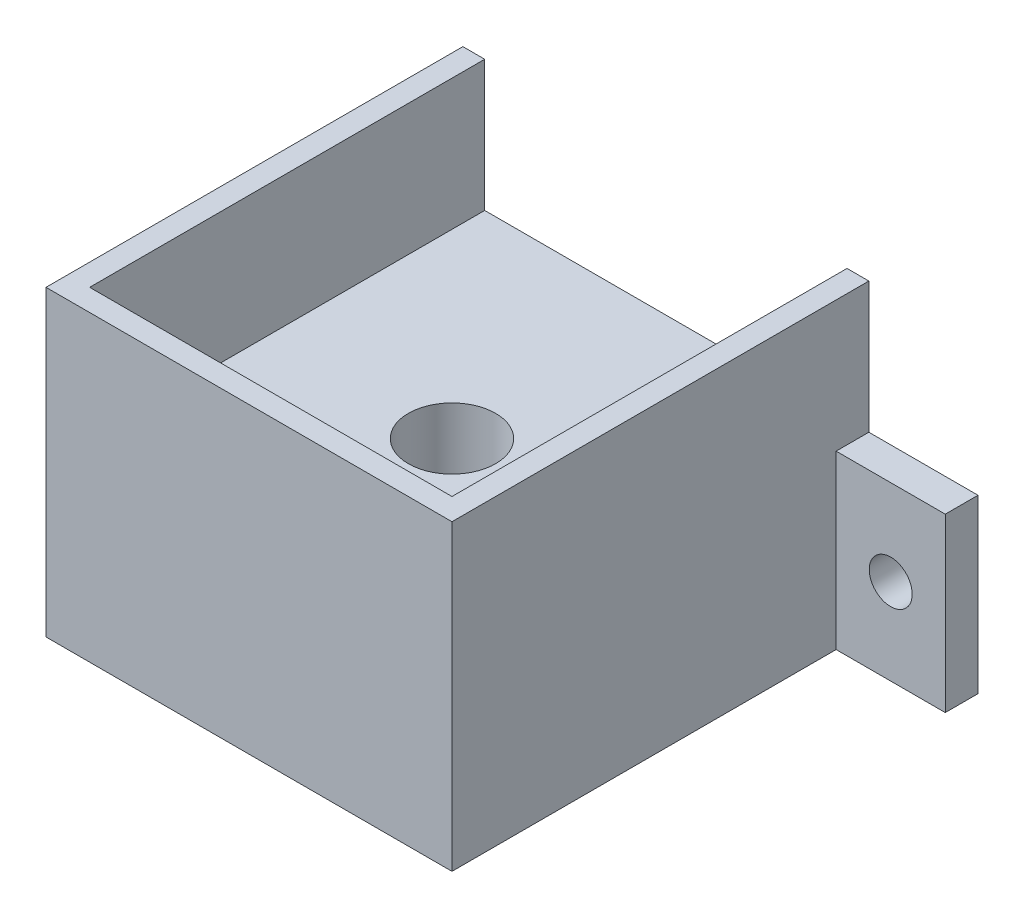
ISO-10303-21;
HEADER;
FILE_DESCRIPTION(('STEP AP214'),'2;1');
FILE_NAME('part.step','',(''),(''),'','','');
FILE_SCHEMA(('AUTOMOTIVE_DESIGN { 1 0 10303 214 1 1 1 1 }'));
ENDSEC;
DATA;
#1=APPLICATION_CONTEXT('core data for automotive mechanical design processes');
#2=APPLICATION_PROTOCOL_DEFINITION('international standard','automotive_design',2000,#1);
#3=PRODUCT_CONTEXT('',#1,'mechanical');
#4=PRODUCT('Part','Part','',(#3));
#5=PRODUCT_RELATED_PRODUCT_CATEGORY('part','',(#4));
#6=PRODUCT_DEFINITION_FORMATION('','',#4);
#7=PRODUCT_DEFINITION_CONTEXT('part definition',#1,'design');
#8=PRODUCT_DEFINITION('design','',#6,#7);
#9=PRODUCT_DEFINITION_SHAPE('','',#8);
#10=(LENGTH_UNIT() NAMED_UNIT(*) SI_UNIT(.MILLI.,.METRE.));
#11=(NAMED_UNIT(*) PLANE_ANGLE_UNIT() SI_UNIT($,.RADIAN.));
#12=(NAMED_UNIT(*) SI_UNIT($,.STERADIAN.) SOLID_ANGLE_UNIT());
#13=UNCERTAINTY_MEASURE_WITH_UNIT(LENGTH_MEASURE(1.E-05),#10,'distance_accuracy_value','');
#14=(GEOMETRIC_REPRESENTATION_CONTEXT(3) GLOBAL_UNCERTAINTY_ASSIGNED_CONTEXT((#13)) GLOBAL_UNIT_ASSIGNED_CONTEXT((#10,
#11,#12)) REPRESENTATION_CONTEXT('',''));
#15=CARTESIAN_POINT('',(0.,0.,0.));
#16=DIRECTION('',(0.,0.,1.));
#17=DIRECTION('',(1.,0.,0.));
#18=AXIS2_PLACEMENT_3D('',#15,#16,#17);
#19=CARTESIAN_POINT('',(0.,20.,0.));
#20=DIRECTION('',(0.,-1.,0.));
#21=DIRECTION('',(0.,0.,-1.));
#22=AXIS2_PLACEMENT_3D('',#19,#20,#21);
#23=PLANE('',#22);
#24=DIRECTION('',(0.,0.,-1.));
#25=VECTOR('',#24,1.);
#26=CARTESIAN_POINT('',(23.622,20.,24.257));
#27=LINE('',#26,#25);
#28=CARTESIAN_POINT('',(23.622,20.,-20.447));
#29=VERTEX_POINT('',#28);
#30=CARTESIAN_POINT('',(23.622,20.,-24.257));
#31=VERTEX_POINT('',#30);
#32=EDGE_CURVE('E11',#29,#31,#27,.T.);
#33=ORIENTED_EDGE('',*,*,#32,.F.);
#34=DIRECTION('',(1.,0.,0.));
#35=VECTOR('',#34,1.);
#36=CARTESIAN_POINT('',(23.622,20.,-20.447));
#37=LINE('',#36,#35);
#38=CARTESIAN_POINT('',(36.322,20.,-20.447));
#39=VERTEX_POINT('',#38);
#40=EDGE_CURVE('E240',#29,#39,#37,.T.);
#41=ORIENTED_EDGE('',*,*,#40,.T.);
#42=DIRECTION('',(0.,0.,-1.));
#43=VECTOR('',#42,1.);
#44=CARTESIAN_POINT('',(36.322,20.,-24.257));
#45=LINE('',#44,#43);
#46=CARTESIAN_POINT('',(36.322,20.,-24.257));
#47=VERTEX_POINT('',#46);
#48=EDGE_CURVE('E65',#39,#47,#45,.T.);
#49=ORIENTED_EDGE('',*,*,#48,.T.);
#50=DIRECTION('',(-1.,0.,0.));
#51=VECTOR('',#50,1.);
#52=CARTESIAN_POINT('',(23.622,20.,-24.257));
#53=LINE('',#52,#51);
#54=EDGE_CURVE('E229',#47,#31,#53,.T.);
#55=ORIENTED_EDGE('',*,*,#54,.T.);
#56=EDGE_LOOP('',(#33,#41,#49,#55));
#57=FACE_BOUND('',#56,.T.);
#58=ADVANCED_FACE('F39',(#57),#23,.F.);
#59=DIRECTION('',(0.,0.,1.));
#60=VECTOR('',#59,1.);
#61=CARTESIAN_POINT('',(-23.622,20.,-24.257));
#62=LINE('',#61,#60);
#63=CARTESIAN_POINT('',(-23.622,20.,-24.257));
#64=VERTEX_POINT('',#63);
#65=CARTESIAN_POINT('',(-23.622,20.,-20.447));
#66=VERTEX_POINT('',#65);
#67=EDGE_CURVE('E166',#64,#66,#62,.T.);
#68=ORIENTED_EDGE('',*,*,#67,.F.);
#69=CARTESIAN_POINT('',(-36.322,20.,-24.257));
#70=VERTEX_POINT('',#69);
#71=EDGE_CURVE('E106',#64,#70,#53,.T.);
#72=ORIENTED_EDGE('',*,*,#71,.T.);
#73=DIRECTION('',(0.,0.,1.));
#74=VECTOR('',#73,1.);
#75=CARTESIAN_POINT('',(-36.322,20.,-24.257));
#76=LINE('',#75,#74);
#77=CARTESIAN_POINT('',(-36.322,20.,-20.447));
#78=VERTEX_POINT('',#77);
#79=EDGE_CURVE('E232',#70,#78,#76,.T.);
#80=ORIENTED_EDGE('',*,*,#79,.T.);
#81=DIRECTION('',(1.,0.,0.));
#82=VECTOR('',#81,1.);
#83=CARTESIAN_POINT('',(-23.622,20.,-20.447));
#84=LINE('',#83,#82);
#85=EDGE_CURVE('E236',#78,#66,#84,.T.);
#86=ORIENTED_EDGE('',*,*,#85,.T.);
#87=EDGE_LOOP('',(#68,#72,#80,#86));
#88=FACE_BOUND('',#87,.T.);
#89=ADVANCED_FACE('F310',(#88),#23,.F.);
#90=CARTESIAN_POINT('',(-23.622,20.,-24.257));
#91=DIRECTION('',(0.,0.,1.));
#92=DIRECTION('',(1.,0.,0.));
#93=AXIS2_PLACEMENT_3D('',#90,#91,#92);
#94=PLANE('',#93);
#95=CARTESIAN_POINT('',(-29.972,10.,-24.257));
#96=DIRECTION('',(0.,0.,-1.));
#97=DIRECTION('',(-1.,0.,0.));
#98=AXIS2_PLACEMENT_3D('',#95,#96,#97);
#99=CIRCLE('',#98,2.5);
#100=CARTESIAN_POINT('',(-32.472,10.,-24.257));
#101=VERTEX_POINT('',#100);
#102=EDGE_CURVE('E382',#101,#101,#99,.T.);
#103=ORIENTED_EDGE('',*,*,#102,.F.);
#104=EDGE_LOOP('',(#103));
#105=FACE_BOUND('',#104,.T.);
#106=CARTESIAN_POINT('',(29.972,10.,-24.257));
#107=DIRECTION('',(0.,0.,1.));
#108=DIRECTION('',(1.,0.,0.));
#109=AXIS2_PLACEMENT_3D('',#106,#107,#108);
#110=CIRCLE('',#109,2.5);
#111=CARTESIAN_POINT('',(32.472,10.,-24.257));
#112=VERTEX_POINT('',#111);
#113=EDGE_CURVE('E206',#112,#112,#110,.T.);
#114=ORIENTED_EDGE('',*,*,#113,.T.);
#115=EDGE_LOOP('',(#114));
#116=FACE_BOUND('',#115,.T.);
#117=DIRECTION('',(-1.,0.,0.));
#118=VECTOR('',#117,1.);
#119=CARTESIAN_POINT('',(-23.622,0.,-24.257));
#120=LINE('',#119,#118);
#121=CARTESIAN_POINT('',(36.322,0.,-24.257));
#122=VERTEX_POINT('',#121);
#123=CARTESIAN_POINT('',(-36.322,0.,-24.257));
#124=VERTEX_POINT('',#123);
#125=EDGE_CURVE('E98',#122,#124,#120,.T.);
#126=ORIENTED_EDGE('',*,*,#125,.T.);
#127=DIRECTION('',(0.,-1.,0.));
#128=VECTOR('',#127,1.);
#129=CARTESIAN_POINT('',(-36.322,20.,-24.257));
#130=LINE('',#129,#128);
#131=EDGE_CURVE('E43',#70,#124,#130,.T.);
#132=ORIENTED_EDGE('',*,*,#131,.F.);
#133=ORIENTED_EDGE('',*,*,#71,.F.);
#134=DIRECTION('',(0.,-1.,0.));
#135=VECTOR('',#134,1.);
#136=CARTESIAN_POINT('',(-23.622,35.24,-24.257));
#137=LINE('',#136,#135);
#138=CARTESIAN_POINT('',(-23.622,35.24,-24.257));
#139=VERTEX_POINT('',#138);
#140=EDGE_CURVE('E200',#139,#64,#137,.T.);
#141=ORIENTED_EDGE('',*,*,#140,.F.);
#142=DIRECTION('',(1.,0.,0.));
#143=VECTOR('',#142,1.);
#144=CARTESIAN_POINT('',(-23.622,35.24,-24.257));
#145=LINE('',#144,#143);
#146=CARTESIAN_POINT('',(-21.082,35.24,-24.257));
#147=VERTEX_POINT('',#146);
#148=EDGE_CURVE('E192',#139,#147,#145,.T.);
#149=ORIENTED_EDGE('',*,*,#148,.T.);
#150=DIRECTION('',(0.,-1.,0.));
#151=VECTOR('',#150,1.);
#152=CARTESIAN_POINT('',(-21.082,35.24,-24.257));
#153=LINE('',#152,#151);
#154=CARTESIAN_POINT('',(-21.082,20.,-24.257));
#155=VERTEX_POINT('',#154);
#156=EDGE_CURVE('E218',#147,#155,#153,.T.);
#157=ORIENTED_EDGE('',*,*,#156,.T.);
#158=CARTESIAN_POINT('',(21.082,20.,-24.257));
#159=VERTEX_POINT('',#158);
#160=EDGE_CURVE('E233',#159,#155,#53,.T.);
#161=ORIENTED_EDGE('',*,*,#160,.F.);
#162=DIRECTION('',(0.,-1.,0.));
#163=VECTOR('',#162,1.);
#164=CARTESIAN_POINT('',(21.082,35.24,-24.257));
#165=LINE('',#164,#163);
#166=CARTESIAN_POINT('',(21.082,35.24,-24.257));
#167=VERTEX_POINT('',#166);
#168=EDGE_CURVE('E56',#167,#159,#165,.T.);
#169=ORIENTED_EDGE('',*,*,#168,.F.);
#170=DIRECTION('',(1.,0.,0.));
#171=VECTOR('',#170,1.);
#172=CARTESIAN_POINT('',(21.082,35.24,-24.257));
#173=LINE('',#172,#171);
#174=CARTESIAN_POINT('',(23.622,35.24,-24.257));
#175=VERTEX_POINT('',#174);
#176=EDGE_CURVE('E159',#167,#175,#173,.T.);
#177=ORIENTED_EDGE('',*,*,#176,.T.);
#178=DIRECTION('',(0.,-1.,0.));
#179=VECTOR('',#178,1.);
#180=CARTESIAN_POINT('',(23.622,35.24,-24.257));
#181=LINE('',#180,#179);
#182=EDGE_CURVE('E169',#175,#31,#181,.T.);
#183=ORIENTED_EDGE('',*,*,#182,.T.);
#184=ORIENTED_EDGE('',*,*,#54,.F.);
#185=DIRECTION('',(0.,-1.,0.));
#186=VECTOR('',#185,1.);
#187=CARTESIAN_POINT('',(36.322,20.,-24.257));
#188=LINE('',#187,#186);
#189=EDGE_CURVE('E245',#47,#122,#188,.T.);
#190=ORIENTED_EDGE('',*,*,#189,.T.);
#191=EDGE_LOOP('',(#126,#132,#133,#141,#149,#157,#161,#169,#177,#183,#184,#190));
#192=FACE_BOUND('',#191,.T.);
#193=ADVANCED_FACE('F41',(#105,#116,#192),#94,.F.);
#194=CARTESIAN_POINT('',(-36.322,20.,-24.257));
#195=DIRECTION('',(1.,0.,0.));
#196=DIRECTION('',(0.,0.,-1.));
#197=AXIS2_PLACEMENT_3D('',#194,#195,#196);
#198=PLANE('',#197);
#199=DIRECTION('',(0.,0.,1.));
#200=VECTOR('',#199,1.);
#201=CARTESIAN_POINT('',(-36.322,0.,-24.257));
#202=LINE('',#201,#200);
#203=CARTESIAN_POINT('',(-36.322,0.,-20.447));
#204=VERTEX_POINT('',#203);
#205=EDGE_CURVE('E248',#124,#204,#202,.T.);
#206=ORIENTED_EDGE('',*,*,#205,.T.);
#207=DIRECTION('',(0.,-1.,0.));
#208=VECTOR('',#207,1.);
#209=CARTESIAN_POINT('',(-36.322,20.,-20.447));
#210=LINE('',#209,#208);
#211=EDGE_CURVE('E290',#78,#204,#210,.T.);
#212=ORIENTED_EDGE('',*,*,#211,.F.);
#213=ORIENTED_EDGE('',*,*,#79,.F.);
#214=ORIENTED_EDGE('',*,*,#131,.T.);
#215=EDGE_LOOP('',(#206,#212,#213,#214));
#216=FACE_BOUND('',#215,.T.);
#217=ADVANCED_FACE('F301',(#216),#198,.F.);
#218=CARTESIAN_POINT('',(-23.622,20.,-20.447));
#219=DIRECTION('',(0.,0.,-1.));
#220=DIRECTION('',(-1.,0.,0.));
#221=AXIS2_PLACEMENT_3D('',#218,#219,#220);
#222=PLANE('',#221);
#223=CARTESIAN_POINT('',(-29.972,10.,-20.447));
#224=DIRECTION('',(0.,0.,-1.));
#225=DIRECTION('',(-1.,0.,0.));
#226=AXIS2_PLACEMENT_3D('',#223,#224,#225);
#227=CIRCLE('',#226,2.5);
#228=CARTESIAN_POINT('',(-32.472,10.,-20.447));
#229=VERTEX_POINT('',#228);
#230=EDGE_CURVE('E379',#229,#229,#227,.T.);
#231=ORIENTED_EDGE('',*,*,#230,.T.);
#232=EDGE_LOOP('',(#231));
#233=FACE_BOUND('',#232,.T.);
#234=DIRECTION('',(1.,0.,0.));
#235=VECTOR('',#234,1.);
#236=CARTESIAN_POINT('',(-23.622,0.,-20.447));
#237=LINE('',#236,#235);
#238=CARTESIAN_POINT('',(-23.622,0.,-20.447));
#239=VERTEX_POINT('',#238);
#240=EDGE_CURVE('E251',#204,#239,#237,.T.);
#241=ORIENTED_EDGE('',*,*,#240,.T.);
#242=DIRECTION('',(0.,-1.,0.));
#243=VECTOR('',#242,1.);
#244=CARTESIAN_POINT('',(-23.622,20.,-20.447));
#245=LINE('',#244,#243);
#246=EDGE_CURVE('E287',#66,#239,#245,.T.);
#247=ORIENTED_EDGE('',*,*,#246,.F.);
#248=ORIENTED_EDGE('',*,*,#85,.F.);
#249=ORIENTED_EDGE('',*,*,#211,.T.);
#250=EDGE_LOOP('',(#241,#247,#248,#249));
#251=FACE_BOUND('',#250,.T.);
#252=ADVANCED_FACE('F306',(#233,#251),#222,.F.);
#253=CARTESIAN_POINT('',(-23.622,20.,24.257));
#254=DIRECTION('',(1.,0.,0.));
#255=DIRECTION('',(0.,0.,-1.));
#256=AXIS2_PLACEMENT_3D('',#253,#254,#255);
#257=PLANE('',#256);
#258=DIRECTION('',(0.,0.,1.));
#259=VECTOR('',#258,1.);
#260=CARTESIAN_POINT('',(-23.622,0.,24.257));
#261=LINE('',#260,#259);
#262=CARTESIAN_POINT('',(-23.622,0.,24.257));
#263=VERTEX_POINT('',#262);
#264=EDGE_CURVE('E254',#239,#263,#261,.T.);
#265=ORIENTED_EDGE('',*,*,#264,.T.);
#266=DIRECTION('',(0.,-1.,0.));
#267=VECTOR('',#266,1.);
#268=CARTESIAN_POINT('',(-23.622,20.,24.257));
#269=LINE('',#268,#267);
#270=CARTESIAN_POINT('',(-23.622,35.24,24.257));
#271=VERTEX_POINT('',#270);
#272=EDGE_CURVE('E283',#271,#263,#269,.T.);
#273=ORIENTED_EDGE('',*,*,#272,.F.);
#274=DIRECTION('',(0.,0.,1.));
#275=VECTOR('',#274,1.);
#276=CARTESIAN_POINT('',(-23.622,35.24,-24.257));
#277=LINE('',#276,#275);
#278=EDGE_CURVE('E196',#139,#271,#277,.T.);
#279=ORIENTED_EDGE('',*,*,#278,.F.);
#280=ORIENTED_EDGE('',*,*,#140,.T.);
#281=ORIENTED_EDGE('',*,*,#67,.T.);
#282=ORIENTED_EDGE('',*,*,#246,.T.);
#283=EDGE_LOOP('',(#265,#273,#279,#280,#281,#282));
#284=FACE_BOUND('',#283,.T.);
#285=ADVANCED_FACE('F308',(#284),#257,.F.);
#286=CARTESIAN_POINT('',(-23.622,20.,24.257));
#287=DIRECTION('',(0.,0.,-1.));
#288=DIRECTION('',(-1.,0.,0.));
#289=AXIS2_PLACEMENT_3D('',#286,#287,#288);
#290=PLANE('',#289);
#291=DIRECTION('',(1.,0.,0.));
#292=VECTOR('',#291,1.);
#293=CARTESIAN_POINT('',(-23.622,0.,24.257));
#294=LINE('',#293,#292);
#295=CARTESIAN_POINT('',(23.622,0.,24.257));
#296=VERTEX_POINT('',#295);
#297=EDGE_CURVE('E257',#263,#296,#294,.T.);
#298=ORIENTED_EDGE('',*,*,#297,.T.);
#299=DIRECTION('',(0.,-1.,0.));
#300=VECTOR('',#299,1.);
#301=CARTESIAN_POINT('',(23.622,20.,24.257));
#302=LINE('',#301,#300);
#303=CARTESIAN_POINT('',(23.622,35.24,24.257));
#304=VERTEX_POINT('',#303);
#305=EDGE_CURVE('E280',#304,#296,#302,.T.);
#306=ORIENTED_EDGE('',*,*,#305,.F.);
#307=DIRECTION('',(1.,0.,0.));
#308=VECTOR('',#307,1.);
#309=CARTESIAN_POINT('',(-23.622,35.24,24.257));
#310=LINE('',#309,#308);
#311=EDGE_CURVE('E162',#271,#304,#310,.T.);
#312=ORIENTED_EDGE('',*,*,#311,.F.);
#313=ORIENTED_EDGE('',*,*,#272,.T.);
#314=EDGE_LOOP('',(#298,#306,#312,#313));
#315=FACE_BOUND('',#314,.T.);
#316=ADVANCED_FACE('F405',(#315),#290,.F.);
#317=CARTESIAN_POINT('',(23.622,20.,24.257));
#318=DIRECTION('',(-1.,0.,0.));
#319=DIRECTION('',(0.,0.,1.));
#320=AXIS2_PLACEMENT_3D('',#317,#318,#319);
#321=PLANE('',#320);
#322=DIRECTION('',(0.,0.,-1.));
#323=VECTOR('',#322,1.);
#324=CARTESIAN_POINT('',(23.622,0.,24.257));
#325=LINE('',#324,#323);
#326=CARTESIAN_POINT('',(23.622,0.,-20.447));
#327=VERTEX_POINT('',#326);
#328=EDGE_CURVE('E260',#296,#327,#325,.T.);
#329=ORIENTED_EDGE('',*,*,#328,.T.);
#330=DIRECTION('',(0.,-1.,0.));
#331=VECTOR('',#330,1.);
#332=CARTESIAN_POINT('',(23.622,20.,-20.447));
#333=LINE('',#332,#331);
#334=EDGE_CURVE('E276',#29,#327,#333,.T.);
#335=ORIENTED_EDGE('',*,*,#334,.F.);
#336=ORIENTED_EDGE('',*,*,#32,.T.);
#337=ORIENTED_EDGE('',*,*,#182,.F.);
#338=DIRECTION('',(0.,0.,-1.));
#339=VECTOR('',#338,1.);
#340=CARTESIAN_POINT('',(23.622,35.24,24.257));
#341=LINE('',#340,#339);
#342=EDGE_CURVE('E154',#304,#175,#341,.T.);
#343=ORIENTED_EDGE('',*,*,#342,.F.);
#344=ORIENTED_EDGE('',*,*,#305,.T.);
#345=EDGE_LOOP('',(#329,#335,#336,#337,#343,#344));
#346=FACE_BOUND('',#345,.T.);
#347=ADVANCED_FACE('F170',(#346),#321,.F.);
#348=CARTESIAN_POINT('',(23.622,20.,-20.447));
#349=DIRECTION('',(0.,0.,-1.));
#350=DIRECTION('',(-1.,0.,0.));
#351=AXIS2_PLACEMENT_3D('',#348,#349,#350);
#352=PLANE('',#351);
#353=CARTESIAN_POINT('',(29.972,10.,-20.447));
#354=DIRECTION('',(0.,0.,1.));
#355=DIRECTION('',(1.,0.,0.));
#356=AXIS2_PLACEMENT_3D('',#353,#354,#355);
#357=CIRCLE('',#356,2.5);
#358=CARTESIAN_POINT('',(32.472,10.,-20.447));
#359=VERTEX_POINT('',#358);
#360=EDGE_CURVE('E386',#359,#359,#357,.T.);
#361=ORIENTED_EDGE('',*,*,#360,.F.);
#362=EDGE_LOOP('',(#361));
#363=FACE_BOUND('',#362,.T.);
#364=DIRECTION('',(1.,0.,0.));
#365=VECTOR('',#364,1.);
#366=CARTESIAN_POINT('',(23.622,0.,-20.447));
#367=LINE('',#366,#365);
#368=CARTESIAN_POINT('',(36.322,0.,-20.447));
#369=VERTEX_POINT('',#368);
#370=EDGE_CURVE('E263',#327,#369,#367,.T.);
#371=ORIENTED_EDGE('',*,*,#370,.T.);
#372=DIRECTION('',(0.,-1.,0.));
#373=VECTOR('',#372,1.);
#374=CARTESIAN_POINT('',(36.322,20.,-20.447));
#375=LINE('',#374,#373);
#376=EDGE_CURVE('E272',#39,#369,#375,.T.);
#377=ORIENTED_EDGE('',*,*,#376,.F.);
#378=ORIENTED_EDGE('',*,*,#40,.F.);
#379=ORIENTED_EDGE('',*,*,#334,.T.);
#380=EDGE_LOOP('',(#371,#377,#378,#379));
#381=FACE_BOUND('',#380,.T.);
#382=ADVANCED_FACE('F330',(#363,#381),#352,.F.);
#383=CARTESIAN_POINT('',(36.322,20.,-24.257));
#384=DIRECTION('',(-1.,0.,0.));
#385=DIRECTION('',(0.,0.,1.));
#386=AXIS2_PLACEMENT_3D('',#383,#384,#385);
#387=PLANE('',#386);
#388=DIRECTION('',(0.,0.,-1.));
#389=VECTOR('',#388,1.);
#390=CARTESIAN_POINT('',(36.322,0.,-24.257));
#391=LINE('',#390,#389);
#392=EDGE_CURVE('E266',#369,#122,#391,.T.);
#393=ORIENTED_EDGE('',*,*,#392,.T.);
#394=ORIENTED_EDGE('',*,*,#189,.F.);
#395=ORIENTED_EDGE('',*,*,#48,.F.);
#396=ORIENTED_EDGE('',*,*,#376,.T.);
#397=EDGE_LOOP('',(#393,#394,#395,#396));
#398=FACE_BOUND('',#397,.T.);
#399=ADVANCED_FACE('F322',(#398),#387,.F.);
#400=CARTESIAN_POINT('',(0.,20.,0.634999999999997));
#401=DIRECTION('',(0.,1.,0.));
#402=DIRECTION('',(0.,0.,1.));
#403=AXIS2_PLACEMENT_3D('',#400,#401,#402);
#404=CIRCLE('',#403,5.08);
#405=CARTESIAN_POINT('',(0.,20.,5.715));
#406=VERTEX_POINT('',#405);
#407=EDGE_CURVE('E336',#406,#406,#404,.T.);
#408=ORIENTED_EDGE('',*,*,#407,.F.);
#409=EDGE_LOOP('',(#408));
#410=FACE_BOUND('',#409,.T.);
#411=ORIENTED_EDGE('',*,*,#160,.T.);
#412=DIRECTION('',(0.,0.,1.));
#413=VECTOR('',#412,1.);
#414=CARTESIAN_POINT('',(-21.082,20.,-24.257));
#415=LINE('',#414,#413);
#416=CARTESIAN_POINT('',(-21.082,20.,21.717));
#417=VERTEX_POINT('',#416);
#418=EDGE_CURVE('E210',#155,#417,#415,.T.);
#419=ORIENTED_EDGE('',*,*,#418,.T.);
#420=DIRECTION('',(1.,0.,0.));
#421=VECTOR('',#420,1.);
#422=CARTESIAN_POINT('',(-21.082,20.,21.717));
#423=LINE('',#422,#421);
#424=CARTESIAN_POINT('',(21.082,20.,21.717));
#425=VERTEX_POINT('',#424);
#426=EDGE_CURVE('E205',#417,#425,#423,.T.);
#427=ORIENTED_EDGE('',*,*,#426,.T.);
#428=DIRECTION('',(0.,0.,-1.));
#429=VECTOR('',#428,1.);
#430=CARTESIAN_POINT('',(21.082,20.,21.717));
#431=LINE('',#430,#429);
#432=EDGE_CURVE('E202',#425,#159,#431,.T.);
#433=ORIENTED_EDGE('',*,*,#432,.T.);
#434=EDGE_LOOP('',(#411,#419,#427,#433));
#435=FACE_BOUND('',#434,.T.);
#436=ADVANCED_FACE('F313',(#410,#435),#23,.F.);
#437=CARTESIAN_POINT('',(0.,0.,0.));
#438=DIRECTION('',(0.,-1.,0.));
#439=DIRECTION('',(0.,0.,-1.));
#440=AXIS2_PLACEMENT_3D('',#437,#438,#439);
#441=PLANE('',#440);
#442=CARTESIAN_POINT('',(0.,0.,0.634999999999997));
#443=DIRECTION('',(0.,1.,0.));
#444=DIRECTION('',(0.,0.,1.));
#445=AXIS2_PLACEMENT_3D('',#442,#443,#444);
#446=CIRCLE('',#445,5.08);
#447=CARTESIAN_POINT('',(0.,0.,5.715));
#448=VERTEX_POINT('',#447);
#449=EDGE_CURVE('E375',#448,#448,#446,.T.);
#450=ORIENTED_EDGE('',*,*,#449,.T.);
#451=EDGE_LOOP('',(#450));
#452=FACE_BOUND('',#451,.T.);
#453=ORIENTED_EDGE('',*,*,#125,.F.);
#454=ORIENTED_EDGE('',*,*,#392,.F.);
#455=ORIENTED_EDGE('',*,*,#370,.F.);
#456=ORIENTED_EDGE('',*,*,#328,.F.);
#457=ORIENTED_EDGE('',*,*,#297,.F.);
#458=ORIENTED_EDGE('',*,*,#264,.F.);
#459=ORIENTED_EDGE('',*,*,#240,.F.);
#460=ORIENTED_EDGE('',*,*,#205,.F.);
#461=EDGE_LOOP('',(#453,#454,#455,#456,#457,#458,#459,#460));
#462=FACE_BOUND('',#461,.T.);
#463=ADVANCED_FACE('F302',(#452,#462),#441,.T.);
#464=CARTESIAN_POINT('',(21.082,35.24,21.717));
#465=DIRECTION('',(-1.,0.,0.));
#466=DIRECTION('',(0.,0.,1.));
#467=AXIS2_PLACEMENT_3D('',#464,#465,#466);
#468=PLANE('',#467);
#469=ORIENTED_EDGE('',*,*,#432,.F.);
#470=DIRECTION('',(0.,-1.,0.));
#471=VECTOR('',#470,1.);
#472=CARTESIAN_POINT('',(21.082,35.24,21.717));
#473=LINE('',#472,#471);
#474=CARTESIAN_POINT('',(21.082,35.24,21.717));
#475=VERTEX_POINT('',#474);
#476=EDGE_CURVE('E224',#475,#425,#473,.T.);
#477=ORIENTED_EDGE('',*,*,#476,.F.);
#478=DIRECTION('',(0.,0.,-1.));
#479=VECTOR('',#478,1.);
#480=CARTESIAN_POINT('',(21.082,35.24,21.717));
#481=LINE('',#480,#479);
#482=EDGE_CURVE('E178',#475,#167,#481,.T.);
#483=ORIENTED_EDGE('',*,*,#482,.T.);
#484=ORIENTED_EDGE('',*,*,#168,.T.);
#485=EDGE_LOOP('',(#469,#477,#483,#484));
#486=FACE_BOUND('',#485,.T.);
#487=ADVANCED_FACE('F328',(#486),#468,.T.);
#488=CARTESIAN_POINT('',(-21.082,35.24,21.717));
#489=DIRECTION('',(0.,0.,-1.));
#490=DIRECTION('',(-1.,0.,0.));
#491=AXIS2_PLACEMENT_3D('',#488,#489,#490);
#492=PLANE('',#491);
#493=ORIENTED_EDGE('',*,*,#426,.F.);
#494=DIRECTION('',(0.,-1.,0.));
#495=VECTOR('',#494,1.);
#496=CARTESIAN_POINT('',(-21.082,35.24,21.717));
#497=LINE('',#496,#495);
#498=CARTESIAN_POINT('',(-21.082,35.24,21.717));
#499=VERTEX_POINT('',#498);
#500=EDGE_CURVE('E221',#499,#417,#497,.T.);
#501=ORIENTED_EDGE('',*,*,#500,.F.);
#502=DIRECTION('',(1.,0.,0.));
#503=VECTOR('',#502,1.);
#504=CARTESIAN_POINT('',(-21.082,35.24,21.717));
#505=LINE('',#504,#503);
#506=EDGE_CURVE('E181',#499,#475,#505,.T.);
#507=ORIENTED_EDGE('',*,*,#506,.T.);
#508=ORIENTED_EDGE('',*,*,#476,.T.);
#509=EDGE_LOOP('',(#493,#501,#507,#508));
#510=FACE_BOUND('',#509,.T.);
#511=ADVANCED_FACE('F348',(#510),#492,.T.);
#512=CARTESIAN_POINT('',(-21.082,35.24,-24.257));
#513=DIRECTION('',(1.,0.,0.));
#514=DIRECTION('',(0.,0.,-1.));
#515=AXIS2_PLACEMENT_3D('',#512,#513,#514);
#516=PLANE('',#515);
#517=ORIENTED_EDGE('',*,*,#418,.F.);
#518=ORIENTED_EDGE('',*,*,#156,.F.);
#519=DIRECTION('',(0.,0.,1.));
#520=VECTOR('',#519,1.);
#521=CARTESIAN_POINT('',(-21.082,35.24,-24.257));
#522=LINE('',#521,#520);
#523=EDGE_CURVE('E188',#147,#499,#522,.T.);
#524=ORIENTED_EDGE('',*,*,#523,.T.);
#525=ORIENTED_EDGE('',*,*,#500,.T.);
#526=EDGE_LOOP('',(#517,#518,#524,#525));
#527=FACE_BOUND('',#526,.T.);
#528=ADVANCED_FACE('F344',(#527),#516,.T.);
#529=CARTESIAN_POINT('',(0.,35.24,0.));
#530=DIRECTION('',(0.,-1.,0.));
#531=DIRECTION('',(0.,0.,-1.));
#532=AXIS2_PLACEMENT_3D('',#529,#530,#531);
#533=PLANE('',#532);
#534=ORIENTED_EDGE('',*,*,#342,.T.);
#535=ORIENTED_EDGE('',*,*,#176,.F.);
#536=ORIENTED_EDGE('',*,*,#482,.F.);
#537=ORIENTED_EDGE('',*,*,#506,.F.);
#538=ORIENTED_EDGE('',*,*,#523,.F.);
#539=ORIENTED_EDGE('',*,*,#148,.F.);
#540=ORIENTED_EDGE('',*,*,#278,.T.);
#541=ORIENTED_EDGE('',*,*,#311,.T.);
#542=EDGE_LOOP('',(#534,#535,#536,#537,#538,#539,#540,#541));
#543=FACE_BOUND('',#542,.T.);
#544=ADVANCED_FACE('F156',(#543),#533,.F.);
#545=CARTESIAN_POINT('',(29.972,10.,-24.257));
#546=DIRECTION('',(0.,0.,1.));
#547=DIRECTION('',(1.,0.,0.));
#548=AXIS2_PLACEMENT_3D('',#545,#546,#547);
#549=CYLINDRICAL_SURFACE('',#548,2.5);
#550=ORIENTED_EDGE('',*,*,#113,.F.);
#551=EDGE_LOOP('',(#550));
#552=FACE_BOUND('',#551,.T.);
#553=ORIENTED_EDGE('',*,*,#360,.T.);
#554=EDGE_LOOP('',(#553));
#555=FACE_BOUND('',#554,.T.);
#556=ADVANCED_FACE('F359',(#552,#555),#549,.F.);
#557=CARTESIAN_POINT('',(-29.972,10.,-24.257));
#558=DIRECTION('',(0.,0.,1.));
#559=DIRECTION('',(1.,0.,0.));
#560=AXIS2_PLACEMENT_3D('',#557,#558,#559);
#561=CYLINDRICAL_SURFACE('',#560,2.5);
#562=ORIENTED_EDGE('',*,*,#102,.T.);
#563=EDGE_LOOP('',(#562));
#564=FACE_BOUND('',#563,.T.);
#565=ORIENTED_EDGE('',*,*,#230,.F.);
#566=EDGE_LOOP('',(#565));
#567=FACE_BOUND('',#566,.T.);
#568=ADVANCED_FACE('F362',(#564,#567),#561,.F.);
#569=CARTESIAN_POINT('',(0.,0.,0.634999999999997));
#570=DIRECTION('',(0.,1.,0.));
#571=DIRECTION('',(0.,0.,1.));
#572=AXIS2_PLACEMENT_3D('',#569,#570,#571);
#573=CYLINDRICAL_SURFACE('',#572,5.08);
#574=ORIENTED_EDGE('',*,*,#449,.F.);
#575=EDGE_LOOP('',(#574));
#576=FACE_BOUND('',#575,.T.);
#577=ORIENTED_EDGE('',*,*,#407,.T.);
#578=EDGE_LOOP('',(#577));
#579=FACE_BOUND('',#578,.T.);
#580=ADVANCED_FACE('F366',(#576,#579),#573,.F.);
#581=CLOSED_SHELL('',(#58,#89,#193,#217,#252,#285,#316,#347,#382,#399,#436,#463,#487,#511,#528,
#544,#556,#568,#580));
#582=MANIFOLD_SOLID_BREP('B2',#581);
#583=ADVANCED_BREP_SHAPE_REPRESENTATION('',(#18,#582),#14);
#584=SHAPE_DEFINITION_REPRESENTATION(#9,#583);
ENDSEC;
END-ISO-10303-21;
